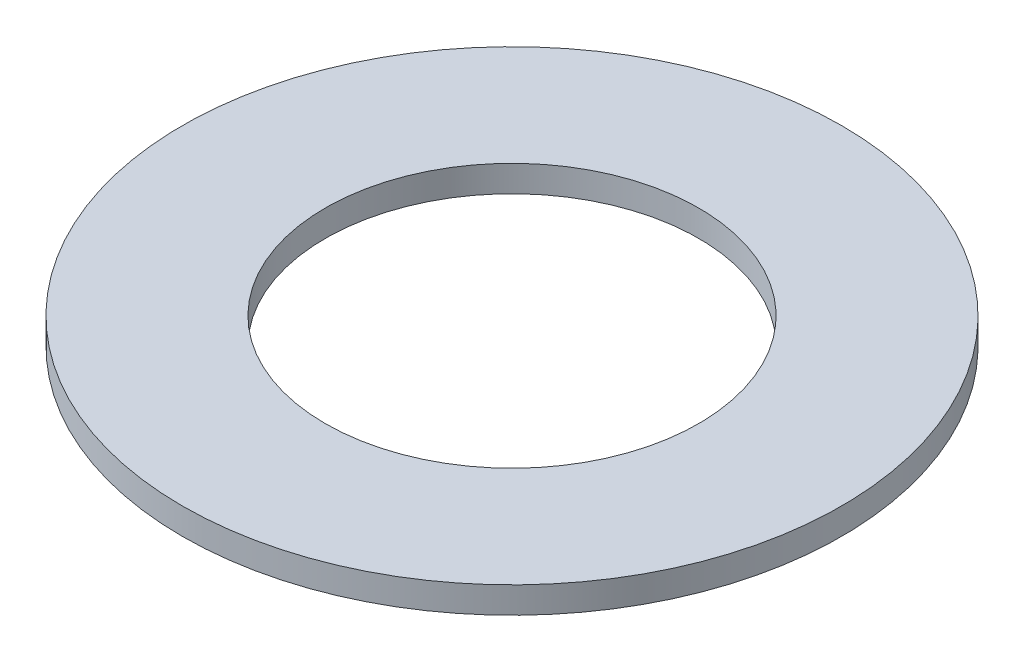
ISO-10303-21;
HEADER;
FILE_DESCRIPTION(('STEP AP214'),'2;1');
FILE_NAME('part.step','',(''),(''),'','','');
FILE_SCHEMA(('AUTOMOTIVE_DESIGN { 1 0 10303 214 1 1 1 1 }'));
ENDSEC;
DATA;
#1=APPLICATION_CONTEXT('core data for automotive mechanical design processes');
#2=APPLICATION_PROTOCOL_DEFINITION('international standard','automotive_design',2000,#1);
#3=PRODUCT_CONTEXT('',#1,'mechanical');
#4=PRODUCT('Part','Part','',(#3));
#5=PRODUCT_RELATED_PRODUCT_CATEGORY('part','',(#4));
#6=PRODUCT_DEFINITION_FORMATION('','',#4);
#7=PRODUCT_DEFINITION_CONTEXT('part definition',#1,'design');
#8=PRODUCT_DEFINITION('design','',#6,#7);
#9=PRODUCT_DEFINITION_SHAPE('','',#8);
#10=(LENGTH_UNIT() NAMED_UNIT(*) SI_UNIT(.MILLI.,.METRE.));
#11=(NAMED_UNIT(*) PLANE_ANGLE_UNIT() SI_UNIT($,.RADIAN.));
#12=(NAMED_UNIT(*) SI_UNIT($,.STERADIAN.) SOLID_ANGLE_UNIT());
#13=UNCERTAINTY_MEASURE_WITH_UNIT(LENGTH_MEASURE(1.E-05),#10,'distance_accuracy_value','');
#14=(GEOMETRIC_REPRESENTATION_CONTEXT(3) GLOBAL_UNCERTAINTY_ASSIGNED_CONTEXT((#13)) GLOBAL_UNIT_ASSIGNED_CONTEXT((#10,
#11,#12)) REPRESENTATION_CONTEXT('',''));
#15=CARTESIAN_POINT('',(0.,0.,0.));
#16=DIRECTION('',(0.,0.,1.));
#17=DIRECTION('',(1.,0.,0.));
#18=AXIS2_PLACEMENT_3D('',#15,#16,#17);
#19=CARTESIAN_POINT('',(0.,6.,0.));
#20=DIRECTION('',(0.,-1.,0.));
#21=DIRECTION('',(0.,0.,-1.));
#22=AXIS2_PLACEMENT_3D('',#19,#20,#21);
#23=CYLINDRICAL_SURFACE('',#22,75.);
#24=CARTESIAN_POINT('',(0.,6.,0.));
#25=DIRECTION('',(0.,1.,0.));
#26=DIRECTION('',(0.,0.,1.));
#27=AXIS2_PLACEMENT_3D('',#24,#25,#26);
#28=CIRCLE('',#27,75.);
#29=CARTESIAN_POINT('',(0.,6.,75.));
#30=VERTEX_POINT('',#29);
#31=EDGE_CURVE('E10',#30,#30,#28,.T.);
#32=ORIENTED_EDGE('',*,*,#31,.F.);
#33=EDGE_LOOP('',(#32));
#34=FACE_BOUND('',#33,.T.);
#35=CARTESIAN_POINT('',(0.,0.,0.));
#36=DIRECTION('',(0.,1.,0.));
#37=DIRECTION('',(0.,0.,1.));
#38=AXIS2_PLACEMENT_3D('',#35,#36,#37);
#39=CIRCLE('',#38,75.);
#40=CARTESIAN_POINT('',(0.,0.,75.));
#41=VERTEX_POINT('',#40);
#42=EDGE_CURVE('E37',#41,#41,#39,.T.);
#43=ORIENTED_EDGE('',*,*,#42,.T.);
#44=EDGE_LOOP('',(#43));
#45=FACE_BOUND('',#44,.T.);
#46=ADVANCED_FACE('F40',(#34,#45),#23,.T.);
#47=CARTESIAN_POINT('',(0.,6.,0.));
#48=DIRECTION('',(0.,1.,0.));
#49=DIRECTION('',(0.,0.,1.));
#50=AXIS2_PLACEMENT_3D('',#47,#48,#49);
#51=PLANE('',#50);
#52=CARTESIAN_POINT('',(0.,6.,0.));
#53=DIRECTION('',(0.,1.,0.));
#54=DIRECTION('',(0.,0.,1.));
#55=AXIS2_PLACEMENT_3D('',#52,#53,#54);
#56=CIRCLE('',#55,42.5);
#57=CARTESIAN_POINT('',(0.,6.,42.5));
#58=VERTEX_POINT('',#57);
#59=EDGE_CURVE('E50',#58,#58,#56,.T.);
#60=ORIENTED_EDGE('',*,*,#59,.F.);
#61=EDGE_LOOP('',(#60));
#62=FACE_BOUND('',#61,.T.);
#63=ORIENTED_EDGE('',*,*,#31,.T.);
#64=EDGE_LOOP('',(#63));
#65=FACE_BOUND('',#64,.T.);
#66=ADVANCED_FACE('F59',(#62,#65),#51,.T.);
#67=CARTESIAN_POINT('',(0.,0.,0.));
#68=DIRECTION('',(0.,1.,0.));
#69=DIRECTION('',(0.,0.,1.));
#70=AXIS2_PLACEMENT_3D('',#67,#68,#69);
#71=PLANE('',#70);
#72=CARTESIAN_POINT('',(0.,0.,0.));
#73=DIRECTION('',(0.,1.,0.));
#74=DIRECTION('',(0.,0.,1.));
#75=AXIS2_PLACEMENT_3D('',#72,#73,#74);
#76=CIRCLE('',#75,42.5);
#77=CARTESIAN_POINT('',(0.,0.,42.5));
#78=VERTEX_POINT('',#77);
#79=EDGE_CURVE('E47',#78,#78,#76,.T.);
#80=ORIENTED_EDGE('',*,*,#79,.T.);
#81=EDGE_LOOP('',(#80));
#82=FACE_BOUND('',#81,.T.);
#83=ORIENTED_EDGE('',*,*,#42,.F.);
#84=EDGE_LOOP('',(#83));
#85=FACE_BOUND('',#84,.T.);
#86=ADVANCED_FACE('F58',(#82,#85),#71,.F.);
#87=CARTESIAN_POINT('',(0.,6.,0.));
#88=DIRECTION('',(0.,-1.,0.));
#89=DIRECTION('',(0.,0.,-1.));
#90=AXIS2_PLACEMENT_3D('',#87,#88,#89);
#91=CYLINDRICAL_SURFACE('',#90,42.5);
#92=ORIENTED_EDGE('',*,*,#59,.T.);
#93=EDGE_LOOP('',(#92));
#94=FACE_BOUND('',#93,.T.);
#95=ORIENTED_EDGE('',*,*,#79,.F.);
#96=EDGE_LOOP('',(#95));
#97=FACE_BOUND('',#96,.T.);
#98=ADVANCED_FACE('F54',(#94,#97),#91,.F.);
#99=CLOSED_SHELL('',(#46,#66,#86,#98));
#100=MANIFOLD_SOLID_BREP('B2',#99);
#101=ADVANCED_BREP_SHAPE_REPRESENTATION('',(#18,#100),#14);
#102=SHAPE_DEFINITION_REPRESENTATION(#9,#101);
ENDSEC;
END-ISO-10303-21;
